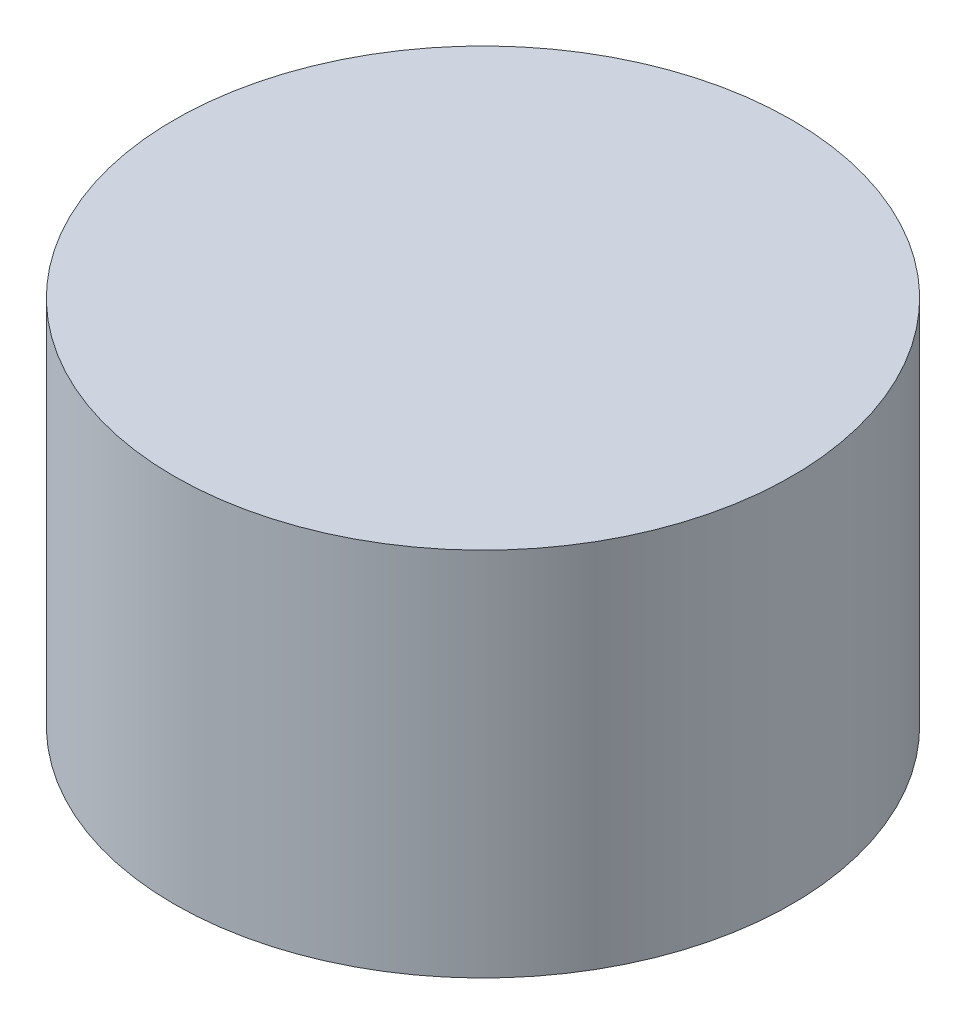
ISO-10303-21;
HEADER;
FILE_DESCRIPTION(('STEP AP214'),'2;1');
FILE_NAME('part.step','',(''),(''),'','','');
FILE_SCHEMA(('AUTOMOTIVE_DESIGN { 1 0 10303 214 1 1 1 1 }'));
ENDSEC;
DATA;
#1=APPLICATION_CONTEXT('core data for automotive mechanical design processes');
#2=APPLICATION_PROTOCOL_DEFINITION('international standard','automotive_design',2000,#1);
#3=PRODUCT_CONTEXT('',#1,'mechanical');
#4=PRODUCT('Part','Part','',(#3));
#5=PRODUCT_RELATED_PRODUCT_CATEGORY('part','',(#4));
#6=PRODUCT_DEFINITION_FORMATION('','',#4);
#7=PRODUCT_DEFINITION_CONTEXT('part definition',#1,'design');
#8=PRODUCT_DEFINITION('design','',#6,#7);
#9=PRODUCT_DEFINITION_SHAPE('','',#8);
#10=(LENGTH_UNIT() NAMED_UNIT(*) SI_UNIT(.MILLI.,.METRE.));
#11=(NAMED_UNIT(*) PLANE_ANGLE_UNIT() SI_UNIT($,.RADIAN.));
#12=(NAMED_UNIT(*) SI_UNIT($,.STERADIAN.) SOLID_ANGLE_UNIT());
#13=UNCERTAINTY_MEASURE_WITH_UNIT(LENGTH_MEASURE(1.E-05),#10,'distance_accuracy_value','');
#14=(GEOMETRIC_REPRESENTATION_CONTEXT(3) GLOBAL_UNCERTAINTY_ASSIGNED_CONTEXT((#13)) GLOBAL_UNIT_ASSIGNED_CONTEXT((#10,
#11,#12)) REPRESENTATION_CONTEXT('',''));
#15=CARTESIAN_POINT('',(0.,0.,0.));
#16=DIRECTION('',(0.,0.,1.));
#17=DIRECTION('',(1.,0.,0.));
#18=AXIS2_PLACEMENT_3D('',#15,#16,#17);
#19=CARTESIAN_POINT('',(0.,6.,0.));
#20=DIRECTION('',(0.,-1.,0.));
#21=DIRECTION('',(0.,0.,-1.));
#22=AXIS2_PLACEMENT_3D('',#19,#20,#21);
#23=CYLINDRICAL_SURFACE('',#22,5.);
#24=CARTESIAN_POINT('',(0.,6.,0.));
#25=DIRECTION('',(0.,1.,0.));
#26=DIRECTION('',(0.,0.,1.));
#27=AXIS2_PLACEMENT_3D('',#24,#25,#26);
#28=CIRCLE('',#27,5.);
#29=CARTESIAN_POINT('',(0.,6.,5.));
#30=VERTEX_POINT('',#29);
#31=EDGE_CURVE('E10',#30,#30,#28,.T.);
#32=ORIENTED_EDGE('',*,*,#31,.F.);
#33=EDGE_LOOP('',(#32));
#34=FACE_BOUND('',#33,.T.);
#35=CARTESIAN_POINT('',(0.,0.,0.));
#36=DIRECTION('',(0.,1.,0.));
#37=DIRECTION('',(0.,0.,1.));
#38=AXIS2_PLACEMENT_3D('',#35,#36,#37);
#39=CIRCLE('',#38,5.);
#40=CARTESIAN_POINT('',(0.,0.,5.));
#41=VERTEX_POINT('',#40);
#42=EDGE_CURVE('E33',#41,#41,#39,.T.);
#43=ORIENTED_EDGE('',*,*,#42,.T.);
#44=EDGE_LOOP('',(#43));
#45=FACE_BOUND('',#44,.T.);
#46=ADVANCED_FACE('F30',(#34,#45),#23,.T.);
#47=CARTESIAN_POINT('',(0.,6.,0.));
#48=DIRECTION('',(0.,1.,0.));
#49=DIRECTION('',(0.,0.,1.));
#50=AXIS2_PLACEMENT_3D('',#47,#48,#49);
#51=PLANE('',#50);
#52=ORIENTED_EDGE('',*,*,#31,.T.);
#53=EDGE_LOOP('',(#52));
#54=FACE_BOUND('',#53,.T.);
#55=ADVANCED_FACE('F45',(#54),#51,.T.);
#56=CARTESIAN_POINT('',(0.,0.,0.));
#57=DIRECTION('',(0.,1.,0.));
#58=DIRECTION('',(0.,0.,1.));
#59=AXIS2_PLACEMENT_3D('',#56,#57,#58);
#60=PLANE('',#59);
#61=ORIENTED_EDGE('',*,*,#42,.F.);
#62=EDGE_LOOP('',(#61));
#63=FACE_BOUND('',#62,.T.);
#64=ADVANCED_FACE('F43',(#63),#60,.F.);
#65=CLOSED_SHELL('',(#46,#55,#64));
#66=MANIFOLD_SOLID_BREP('B2',#65);
#67=ADVANCED_BREP_SHAPE_REPRESENTATION('',(#18,#66),#14);
#68=SHAPE_DEFINITION_REPRESENTATION(#9,#67);
ENDSEC;
END-ISO-10303-21;
